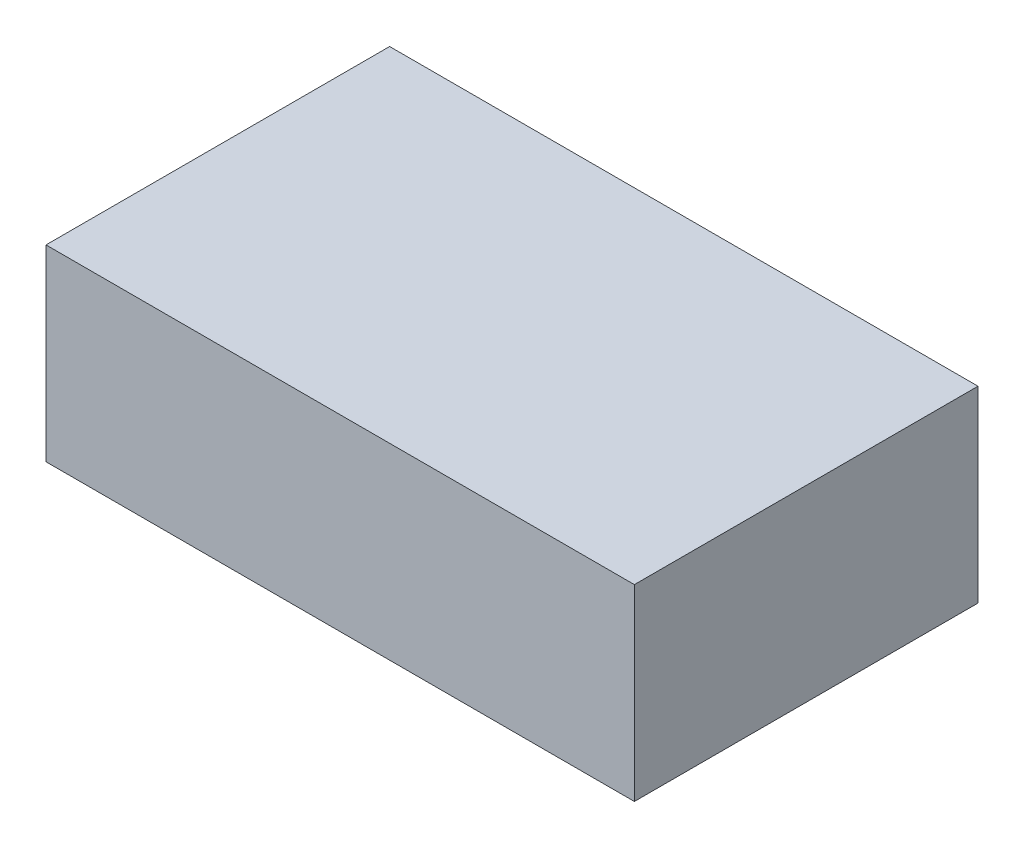
ISO-10303-21;
HEADER;
FILE_DESCRIPTION(('STEP AP214'),'2;1');
FILE_NAME('part.step','',(''),(''),'','','');
FILE_SCHEMA(('AUTOMOTIVE_DESIGN { 1 0 10303 214 1 1 1 1 }'));
ENDSEC;
DATA;
#1=APPLICATION_CONTEXT('core data for automotive mechanical design processes');
#2=APPLICATION_PROTOCOL_DEFINITION('international standard','automotive_design',2000,#1);
#3=PRODUCT_CONTEXT('',#1,'mechanical');
#4=PRODUCT('Part','Part','',(#3));
#5=PRODUCT_RELATED_PRODUCT_CATEGORY('part','',(#4));
#6=PRODUCT_DEFINITION_FORMATION('','',#4);
#7=PRODUCT_DEFINITION_CONTEXT('part definition',#1,'design');
#8=PRODUCT_DEFINITION('design','',#6,#7);
#9=PRODUCT_DEFINITION_SHAPE('','',#8);
#10=(LENGTH_UNIT() NAMED_UNIT(*) SI_UNIT(.MILLI.,.METRE.));
#11=(NAMED_UNIT(*) PLANE_ANGLE_UNIT() SI_UNIT($,.RADIAN.));
#12=(NAMED_UNIT(*) SI_UNIT($,.STERADIAN.) SOLID_ANGLE_UNIT());
#13=UNCERTAINTY_MEASURE_WITH_UNIT(LENGTH_MEASURE(1.E-05),#10,'distance_accuracy_value','');
#14=(GEOMETRIC_REPRESENTATION_CONTEXT(3) GLOBAL_UNCERTAINTY_ASSIGNED_CONTEXT((#13)) GLOBAL_UNIT_ASSIGNED_CONTEXT((#10,
#11,#12)) REPRESENTATION_CONTEXT('',''));
#15=CARTESIAN_POINT('',(0.,0.,0.));
#16=DIRECTION('',(0.,0.,1.));
#17=DIRECTION('',(1.,0.,0.));
#18=AXIS2_PLACEMENT_3D('',#15,#16,#17);
#19=CARTESIAN_POINT('',(53.25,34.,31.1));
#20=DIRECTION('',(-1.,0.,0.));
#21=DIRECTION('',(0.,0.,1.));
#22=AXIS2_PLACEMENT_3D('',#19,#20,#21);
#23=PLANE('',#22);
#24=DIRECTION('',(0.,0.,-1.));
#25=VECTOR('',#24,1.);
#26=CARTESIAN_POINT('',(53.25,0.,31.1));
#27=LINE('',#26,#25);
#28=CARTESIAN_POINT('',(53.25,0.,31.1));
#29=VERTEX_POINT('',#28);
#30=CARTESIAN_POINT('',(53.25,0.,-31.1));
#31=VERTEX_POINT('',#30);
#32=EDGE_CURVE('E96',#29,#31,#27,.T.);
#33=ORIENTED_EDGE('',*,*,#32,.T.);
#34=DIRECTION('',(0.,-1.,0.));
#35=VECTOR('',#34,1.);
#36=CARTESIAN_POINT('',(53.25,34.,-31.1));
#37=LINE('',#36,#35);
#38=CARTESIAN_POINT('',(53.25,34.,-31.1));
#39=VERTEX_POINT('',#38);
#40=EDGE_CURVE('E11',#39,#31,#37,.T.);
#41=ORIENTED_EDGE('',*,*,#40,.F.);
#42=DIRECTION('',(0.,0.,-1.));
#43=VECTOR('',#42,1.);
#44=CARTESIAN_POINT('',(53.25,34.,31.1));
#45=LINE('',#44,#43);
#46=CARTESIAN_POINT('',(53.25,34.,31.1));
#47=VERTEX_POINT('',#46);
#48=EDGE_CURVE('E84',#47,#39,#45,.T.);
#49=ORIENTED_EDGE('',*,*,#48,.F.);
#50=DIRECTION('',(0.,-1.,0.));
#51=VECTOR('',#50,1.);
#52=CARTESIAN_POINT('',(53.25,34.,31.1));
#53=LINE('',#52,#51);
#54=EDGE_CURVE('E92',#47,#29,#53,.T.);
#55=ORIENTED_EDGE('',*,*,#54,.T.);
#56=EDGE_LOOP('',(#33,#41,#49,#55));
#57=FACE_BOUND('',#56,.T.);
#58=ADVANCED_FACE('F33',(#57),#23,.F.);
#59=CARTESIAN_POINT('',(-53.25,34.,-31.1));
#60=DIRECTION('',(0.,0.,1.));
#61=DIRECTION('',(1.,0.,0.));
#62=AXIS2_PLACEMENT_3D('',#59,#60,#61);
#63=PLANE('',#62);
#64=DIRECTION('',(-1.,0.,0.));
#65=VECTOR('',#64,1.);
#66=CARTESIAN_POINT('',(-53.25,0.,-31.1));
#67=LINE('',#66,#65);
#68=CARTESIAN_POINT('',(-53.25,0.,-31.1));
#69=VERTEX_POINT('',#68);
#70=EDGE_CURVE('E88',#31,#69,#67,.T.);
#71=ORIENTED_EDGE('',*,*,#70,.T.);
#72=DIRECTION('',(0.,-1.,0.));
#73=VECTOR('',#72,1.);
#74=CARTESIAN_POINT('',(-53.25,34.,-31.1));
#75=LINE('',#74,#73);
#76=CARTESIAN_POINT('',(-53.25,34.,-31.1));
#77=VERTEX_POINT('',#76);
#78=EDGE_CURVE('E41',#77,#69,#75,.T.);
#79=ORIENTED_EDGE('',*,*,#78,.F.);
#80=DIRECTION('',(-1.,0.,0.));
#81=VECTOR('',#80,1.);
#82=CARTESIAN_POINT('',(-53.25,34.,-31.1));
#83=LINE('',#82,#81);
#84=EDGE_CURVE('E79',#39,#77,#83,.T.);
#85=ORIENTED_EDGE('',*,*,#84,.F.);
#86=ORIENTED_EDGE('',*,*,#40,.T.);
#87=EDGE_LOOP('',(#71,#79,#85,#86));
#88=FACE_BOUND('',#87,.T.);
#89=ADVANCED_FACE('F87',(#88),#63,.F.);
#90=CARTESIAN_POINT('',(-53.25,34.,31.1));
#91=DIRECTION('',(1.,0.,0.));
#92=DIRECTION('',(0.,0.,-1.));
#93=AXIS2_PLACEMENT_3D('',#90,#91,#92);
#94=PLANE('',#93);
#95=DIRECTION('',(0.,0.,1.));
#96=VECTOR('',#95,1.);
#97=CARTESIAN_POINT('',(-53.25,0.,31.1));
#98=LINE('',#97,#96);
#99=CARTESIAN_POINT('',(-53.25,0.,31.1));
#100=VERTEX_POINT('',#99);
#101=EDGE_CURVE('E66',#69,#100,#98,.T.);
#102=ORIENTED_EDGE('',*,*,#101,.T.);
#103=DIRECTION('',(0.,-1.,0.));
#104=VECTOR('',#103,1.);
#105=CARTESIAN_POINT('',(-53.25,34.,31.1));
#106=LINE('',#105,#104);
#107=CARTESIAN_POINT('',(-53.25,34.,31.1));
#108=VERTEX_POINT('',#107);
#109=EDGE_CURVE('E89',#108,#100,#106,.T.);
#110=ORIENTED_EDGE('',*,*,#109,.F.);
#111=DIRECTION('',(0.,0.,1.));
#112=VECTOR('',#111,1.);
#113=CARTESIAN_POINT('',(-53.25,34.,31.1));
#114=LINE('',#113,#112);
#115=EDGE_CURVE('E82',#77,#108,#114,.T.);
#116=ORIENTED_EDGE('',*,*,#115,.F.);
#117=ORIENTED_EDGE('',*,*,#78,.T.);
#118=EDGE_LOOP('',(#102,#110,#116,#117));
#119=FACE_BOUND('',#118,.T.);
#120=ADVANCED_FACE('F90',(#119),#94,.F.);
#121=CARTESIAN_POINT('',(-53.25,34.,31.1));
#122=DIRECTION('',(0.,0.,-1.));
#123=DIRECTION('',(-1.,0.,0.));
#124=AXIS2_PLACEMENT_3D('',#121,#122,#123);
#125=PLANE('',#124);
#126=DIRECTION('',(1.,0.,0.));
#127=VECTOR('',#126,1.);
#128=CARTESIAN_POINT('',(-53.25,0.,31.1));
#129=LINE('',#128,#127);
#130=EDGE_CURVE('E72',#100,#29,#129,.T.);
#131=ORIENTED_EDGE('',*,*,#130,.T.);
#132=ORIENTED_EDGE('',*,*,#54,.F.);
#133=DIRECTION('',(1.,0.,0.));
#134=VECTOR('',#133,1.);
#135=CARTESIAN_POINT('',(-53.25,34.,31.1));
#136=LINE('',#135,#134);
#137=EDGE_CURVE('E49',#108,#47,#136,.T.);
#138=ORIENTED_EDGE('',*,*,#137,.F.);
#139=ORIENTED_EDGE('',*,*,#109,.T.);
#140=EDGE_LOOP('',(#131,#132,#138,#139));
#141=FACE_BOUND('',#140,.T.);
#142=ADVANCED_FACE('F103',(#141),#125,.F.);
#143=CARTESIAN_POINT('',(0.,34.,0.));
#144=DIRECTION('',(0.,-1.,0.));
#145=DIRECTION('',(0.,0.,-1.));
#146=AXIS2_PLACEMENT_3D('',#143,#144,#145);
#147=PLANE('',#146);
#148=ORIENTED_EDGE('',*,*,#48,.T.);
#149=ORIENTED_EDGE('',*,*,#84,.T.);
#150=ORIENTED_EDGE('',*,*,#115,.T.);
#151=ORIENTED_EDGE('',*,*,#137,.T.);
#152=EDGE_LOOP('',(#148,#149,#150,#151));
#153=FACE_BOUND('',#152,.T.);
#154=ADVANCED_FACE('F80',(#153),#147,.F.);
#155=CARTESIAN_POINT('',(0.,0.,0.));
#156=DIRECTION('',(0.,-1.,0.));
#157=DIRECTION('',(0.,0.,-1.));
#158=AXIS2_PLACEMENT_3D('',#155,#156,#157);
#159=PLANE('',#158);
#160=ORIENTED_EDGE('',*,*,#32,.F.);
#161=ORIENTED_EDGE('',*,*,#130,.F.);
#162=ORIENTED_EDGE('',*,*,#101,.F.);
#163=ORIENTED_EDGE('',*,*,#70,.F.);
#164=EDGE_LOOP('',(#160,#161,#162,#163));
#165=FACE_BOUND('',#164,.T.);
#166=ADVANCED_FACE('F106',(#165),#159,.T.);
#167=CLOSED_SHELL('',(#58,#89,#120,#142,#154,#166));
#168=MANIFOLD_SOLID_BREP('B2',#167);
#169=ADVANCED_BREP_SHAPE_REPRESENTATION('',(#18,#168),#14);
#170=SHAPE_DEFINITION_REPRESENTATION(#9,#169);
ENDSEC;
END-ISO-10303-21;
